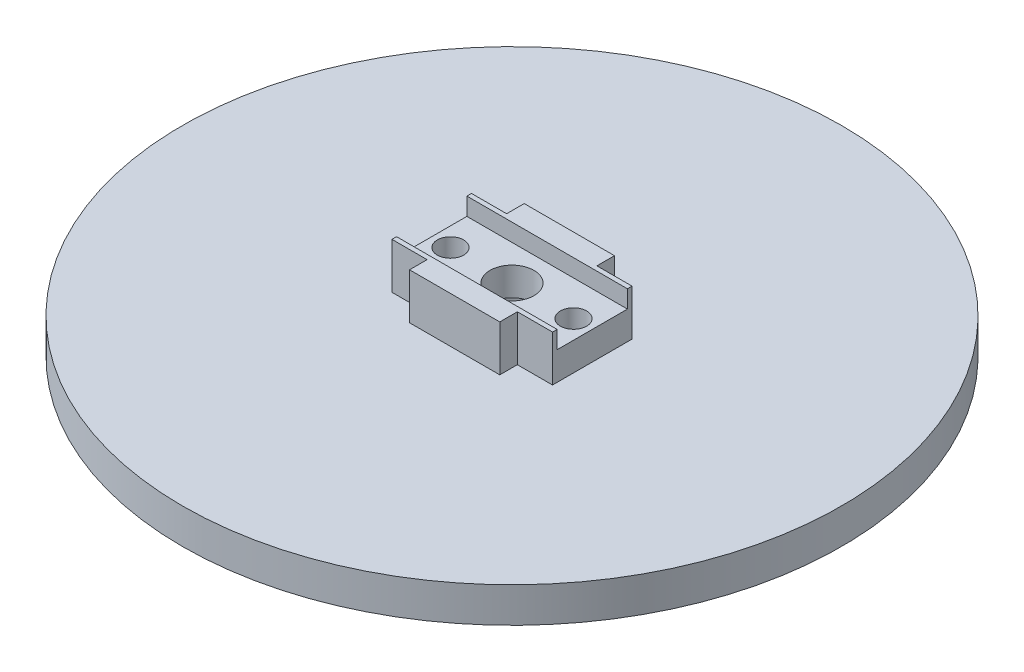
ISO-10303-21;
HEADER;
FILE_DESCRIPTION(('STEP AP214'),'2;1');
FILE_NAME('part.step','',(''),(''),'','','');
FILE_SCHEMA(('AUTOMOTIVE_DESIGN { 1 0 10303 214 1 1 1 1 }'));
ENDSEC;
DATA;
#1=APPLICATION_CONTEXT('core data for automotive mechanical design processes');
#2=APPLICATION_PROTOCOL_DEFINITION('international standard','automotive_design',2000,#1);
#3=PRODUCT_CONTEXT('',#1,'mechanical');
#4=PRODUCT('Part','Part','',(#3));
#5=PRODUCT_RELATED_PRODUCT_CATEGORY('part','',(#4));
#6=PRODUCT_DEFINITION_FORMATION('','',#4);
#7=PRODUCT_DEFINITION_CONTEXT('part definition',#1,'design');
#8=PRODUCT_DEFINITION('design','',#6,#7);
#9=PRODUCT_DEFINITION_SHAPE('','',#8);
#10=(LENGTH_UNIT() NAMED_UNIT(*) SI_UNIT(.MILLI.,.METRE.));
#11=(NAMED_UNIT(*) PLANE_ANGLE_UNIT() SI_UNIT($,.RADIAN.));
#12=(NAMED_UNIT(*) SI_UNIT($,.STERADIAN.) SOLID_ANGLE_UNIT());
#13=UNCERTAINTY_MEASURE_WITH_UNIT(LENGTH_MEASURE(1.E-05),#10,'distance_accuracy_value','');
#14=(GEOMETRIC_REPRESENTATION_CONTEXT(3) GLOBAL_UNCERTAINTY_ASSIGNED_CONTEXT((#13)) GLOBAL_UNIT_ASSIGNED_CONTEXT((#10,
#11,#12)) REPRESENTATION_CONTEXT('',''));
#15=CARTESIAN_POINT('',(0.,0.,0.));
#16=DIRECTION('',(0.,0.,1.));
#17=DIRECTION('',(1.,0.,0.));
#18=AXIS2_PLACEMENT_3D('',#15,#16,#17);
#19=CARTESIAN_POINT('',(0.,9.22,0.));
#20=DIRECTION('',(0.,1.,0.));
#21=DIRECTION('',(0.,0.,1.));
#22=AXIS2_PLACEMENT_3D('',#19,#20,#21);
#23=PLANE('',#22);
#24=DIRECTION('',(1.,0.,0.));
#25=VECTOR('',#24,1.);
#26=CARTESIAN_POINT('',(0.,9.22,4.));
#27=LINE('',#26,#25);
#28=CARTESIAN_POINT('',(-9.135,9.22,4.));
#29=VERTEX_POINT('',#28);
#30=CARTESIAN_POINT('',(9.135,9.22,4.));
#31=VERTEX_POINT('',#30);
#32=EDGE_CURVE('E49',#29,#31,#27,.T.);
#33=ORIENTED_EDGE('',*,*,#32,.F.);
#34=DIRECTION('',(0.,0.,1.));
#35=VECTOR('',#34,1.);
#36=CARTESIAN_POINT('',(-9.135,9.22,-6.525));
#37=LINE('',#36,#35);
#38=CARTESIAN_POINT('',(-9.135,9.22,4.525));
#39=VERTEX_POINT('',#38);
#40=EDGE_CURVE('E182',#29,#39,#37,.T.);
#41=ORIENTED_EDGE('',*,*,#40,.T.);
#42=DIRECTION('',(-1.,0.,0.));
#43=VECTOR('',#42,1.);
#44=CARTESIAN_POINT('',(-5.135,9.22,4.525));
#45=LINE('',#44,#43);
#46=CARTESIAN_POINT('',(-5.135,9.22,4.525));
#47=VERTEX_POINT('',#46);
#48=EDGE_CURVE('E286',#47,#39,#45,.T.);
#49=ORIENTED_EDGE('',*,*,#48,.F.);
#50=DIRECTION('',(0.,0.,-1.));
#51=VECTOR('',#50,1.);
#52=CARTESIAN_POINT('',(-5.135,9.22,4.525));
#53=LINE('',#52,#51);
#54=CARTESIAN_POINT('',(-5.135,9.22,6.525));
#55=VERTEX_POINT('',#54);
#56=EDGE_CURVE('E282',#55,#47,#53,.T.);
#57=ORIENTED_EDGE('',*,*,#56,.F.);
#58=DIRECTION('',(1.,0.,0.));
#59=VECTOR('',#58,1.);
#60=CARTESIAN_POINT('',(-9.135,9.22,6.525));
#61=LINE('',#60,#59);
#62=CARTESIAN_POINT('',(5.135,9.22,6.525));
#63=VERTEX_POINT('',#62);
#64=EDGE_CURVE('E181',#55,#63,#61,.T.);
#65=ORIENTED_EDGE('',*,*,#64,.T.);
#66=DIRECTION('',(0.,0.,1.));
#67=VECTOR('',#66,1.);
#68=CARTESIAN_POINT('',(5.135,9.22,4.525));
#69=LINE('',#68,#67);
#70=CARTESIAN_POINT('',(5.135,9.22,4.525));
#71=VERTEX_POINT('',#70);
#72=EDGE_CURVE('E251',#71,#63,#69,.T.);
#73=ORIENTED_EDGE('',*,*,#72,.F.);
#74=DIRECTION('',(-1.,0.,0.));
#75=VECTOR('',#74,1.);
#76=CARTESIAN_POINT('',(9.135,9.22,4.525));
#77=LINE('',#76,#75);
#78=CARTESIAN_POINT('',(9.135,9.22,4.525));
#79=VERTEX_POINT('',#78);
#80=EDGE_CURVE('E250',#79,#71,#77,.T.);
#81=ORIENTED_EDGE('',*,*,#80,.F.);
#82=DIRECTION('',(0.,0.,-1.));
#83=VECTOR('',#82,1.);
#84=CARTESIAN_POINT('',(9.135,9.22,-6.525));
#85=LINE('',#84,#83);
#86=EDGE_CURVE('E194',#79,#31,#85,.T.);
#87=ORIENTED_EDGE('',*,*,#86,.T.);
#88=EDGE_LOOP('',(#33,#41,#49,#57,#65,#73,#81,#87));
#89=FACE_BOUND('',#88,.T.);
#90=ADVANCED_FACE('F40',(#89),#23,.T.);
#91=CARTESIAN_POINT('',(0.,4.,0.));
#92=DIRECTION('',(0.,1.,0.));
#93=DIRECTION('',(0.,0.,1.));
#94=AXIS2_PLACEMENT_3D('',#91,#92,#93);
#95=PLANE('',#94);
#96=DIRECTION('',(1.,0.,0.));
#97=VECTOR('',#96,1.);
#98=CARTESIAN_POINT('',(-5.135,4.,4.525));
#99=LINE('',#98,#97);
#100=CARTESIAN_POINT('',(-9.135,4.,4.525));
#101=VERTEX_POINT('',#100);
#102=CARTESIAN_POINT('',(-5.135,4.,4.525));
#103=VERTEX_POINT('',#102);
#104=EDGE_CURVE('E261',#101,#103,#99,.T.);
#105=ORIENTED_EDGE('',*,*,#104,.F.);
#106=DIRECTION('',(0.,0.,1.));
#107=VECTOR('',#106,1.);
#108=CARTESIAN_POINT('',(-9.135,4.,-6.525));
#109=LINE('',#108,#107);
#110=CARTESIAN_POINT('',(-9.135,4.,-4.525));
#111=VERTEX_POINT('',#110);
#112=EDGE_CURVE('E203',#111,#101,#109,.T.);
#113=ORIENTED_EDGE('',*,*,#112,.F.);
#114=DIRECTION('',(-1.,0.,0.));
#115=VECTOR('',#114,1.);
#116=CARTESIAN_POINT('',(-5.135,4.,-4.525));
#117=LINE('',#116,#115);
#118=CARTESIAN_POINT('',(-5.135,4.,-4.525));
#119=VERTEX_POINT('',#118);
#120=EDGE_CURVE('E191',#119,#111,#117,.T.);
#121=ORIENTED_EDGE('',*,*,#120,.F.);
#122=DIRECTION('',(0.,0.,1.));
#123=VECTOR('',#122,1.);
#124=CARTESIAN_POINT('',(-5.135,4.,-6.525));
#125=LINE('',#124,#123);
#126=CARTESIAN_POINT('',(-5.135,4.,-6.525));
#127=VERTEX_POINT('',#126);
#128=EDGE_CURVE('E321',#127,#119,#125,.T.);
#129=ORIENTED_EDGE('',*,*,#128,.F.);
#130=DIRECTION('',(-1.,0.,0.));
#131=VECTOR('',#130,1.);
#132=CARTESIAN_POINT('',(-9.135,4.,-6.525));
#133=LINE('',#132,#131);
#134=CARTESIAN_POINT('',(5.13499999999999,4.,-6.525));
#135=VERTEX_POINT('',#134);
#136=EDGE_CURVE('E189',#135,#127,#133,.T.);
#137=ORIENTED_EDGE('',*,*,#136,.F.);
#138=DIRECTION('',(0.,0.,-1.));
#139=VECTOR('',#138,1.);
#140=CARTESIAN_POINT('',(5.13499999999999,4.,-6.525));
#141=LINE('',#140,#139);
#142=CARTESIAN_POINT('',(5.13499999999999,4.,-4.525));
#143=VERTEX_POINT('',#142);
#144=EDGE_CURVE('E287',#143,#135,#141,.T.);
#145=ORIENTED_EDGE('',*,*,#144,.F.);
#146=DIRECTION('',(-1.,0.,0.));
#147=VECTOR('',#146,1.);
#148=CARTESIAN_POINT('',(9.13499999999999,4.,-4.525));
#149=LINE('',#148,#147);
#150=CARTESIAN_POINT('',(9.13499999999999,4.,-4.525));
#151=VERTEX_POINT('',#150);
#152=EDGE_CURVE('E300',#151,#143,#149,.T.);
#153=ORIENTED_EDGE('',*,*,#152,.F.);
#154=DIRECTION('',(0.,0.,-1.));
#155=VECTOR('',#154,1.);
#156=CARTESIAN_POINT('',(9.135,4.,-6.525));
#157=LINE('',#156,#155);
#158=CARTESIAN_POINT('',(9.135,4.,4.525));
#159=VERTEX_POINT('',#158);
#160=EDGE_CURVE('E211',#159,#151,#157,.T.);
#161=ORIENTED_EDGE('',*,*,#160,.F.);
#162=DIRECTION('',(1.,0.,0.));
#163=VECTOR('',#162,1.);
#164=CARTESIAN_POINT('',(9.135,4.,4.525));
#165=LINE('',#164,#163);
#166=CARTESIAN_POINT('',(5.135,4.,4.525));
#167=VERTEX_POINT('',#166);
#168=EDGE_CURVE('E276',#167,#159,#165,.T.);
#169=ORIENTED_EDGE('',*,*,#168,.F.);
#170=DIRECTION('',(0.,0.,-1.));
#171=VECTOR('',#170,1.);
#172=CARTESIAN_POINT('',(5.135,4.,4.525));
#173=LINE('',#172,#171);
#174=CARTESIAN_POINT('',(5.135,4.,6.525));
#175=VERTEX_POINT('',#174);
#176=EDGE_CURVE('E264',#175,#167,#173,.T.);
#177=ORIENTED_EDGE('',*,*,#176,.F.);
#178=DIRECTION('',(1.,0.,0.));
#179=VECTOR('',#178,1.);
#180=CARTESIAN_POINT('',(-9.135,4.,6.525));
#181=LINE('',#180,#179);
#182=CARTESIAN_POINT('',(-5.135,4.,6.525));
#183=VERTEX_POINT('',#182);
#184=EDGE_CURVE('E207',#183,#175,#181,.T.);
#185=ORIENTED_EDGE('',*,*,#184,.F.);
#186=DIRECTION('',(0.,0.,1.));
#187=VECTOR('',#186,1.);
#188=CARTESIAN_POINT('',(-5.135,4.,4.525));
#189=LINE('',#188,#187);
#190=EDGE_CURVE('E255',#103,#183,#189,.T.);
#191=ORIENTED_EDGE('',*,*,#190,.F.);
#192=EDGE_LOOP('',(#105,#113,#121,#129,#137,#145,#153,#161,#169,#177,#185,#191));
#193=FACE_BOUND('',#192,.T.);
#194=CARTESIAN_POINT('',(0.,4.,0.));
#195=DIRECTION('',(0.,1.,0.));
#196=DIRECTION('',(0.,0.,1.));
#197=AXIS2_PLACEMENT_3D('',#194,#195,#196);
#198=CIRCLE('',#197,37.5);
#199=CARTESIAN_POINT('',(0.,4.,37.5));
#200=VERTEX_POINT('',#199);
#201=EDGE_CURVE('E161',#200,#200,#198,.T.);
#202=ORIENTED_EDGE('',*,*,#201,.T.);
#203=EDGE_LOOP('',(#202));
#204=FACE_BOUND('',#203,.T.);
#205=ADVANCED_FACE('F343',(#193,#204),#95,.T.);
#206=CARTESIAN_POINT('',(0.,4.,0.));
#207=DIRECTION('',(0.,-1.,0.));
#208=DIRECTION('',(0.,0.,-1.));
#209=AXIS2_PLACEMENT_3D('',#206,#207,#208);
#210=CYLINDRICAL_SURFACE('',#209,37.5);
#211=ORIENTED_EDGE('',*,*,#201,.F.);
#212=EDGE_LOOP('',(#211));
#213=FACE_BOUND('',#212,.T.);
#214=CARTESIAN_POINT('',(0.,0.,0.));
#215=DIRECTION('',(0.,1.,0.));
#216=DIRECTION('',(0.,0.,1.));
#217=AXIS2_PLACEMENT_3D('',#214,#215,#216);
#218=CIRCLE('',#217,37.5);
#219=CARTESIAN_POINT('',(0.,0.,37.5));
#220=VERTEX_POINT('',#219);
#221=EDGE_CURVE('E225',#220,#220,#218,.T.);
#222=ORIENTED_EDGE('',*,*,#221,.T.);
#223=EDGE_LOOP('',(#222));
#224=FACE_BOUND('',#223,.T.);
#225=ADVANCED_FACE('F42',(#213,#224),#210,.T.);
#226=CARTESIAN_POINT('',(0.,0.,0.));
#227=DIRECTION('',(0.,1.,0.));
#228=DIRECTION('',(0.,0.,1.));
#229=AXIS2_PLACEMENT_3D('',#226,#227,#228);
#230=PLANE('',#229);
#231=CARTESIAN_POINT('',(0.,0.,0.));
#232=DIRECTION('',(0.,1.,0.));
#233=DIRECTION('',(0.,0.,1.));
#234=AXIS2_PLACEMENT_3D('',#231,#232,#233);
#235=CIRCLE('',#234,5.22);
#236=CARTESIAN_POINT('',(0.,0.,5.22));
#237=VERTEX_POINT('',#236);
#238=EDGE_CURVE('E221',#237,#237,#235,.T.);
#239=ORIENTED_EDGE('',*,*,#238,.T.);
#240=EDGE_LOOP('',(#239));
#241=FACE_BOUND('',#240,.T.);
#242=ORIENTED_EDGE('',*,*,#221,.F.);
#243=EDGE_LOOP('',(#242));
#244=FACE_BOUND('',#243,.T.);
#245=ADVANCED_FACE('F418',(#241,#244),#230,.F.);
#246=CARTESIAN_POINT('',(0.,-9.05,0.));
#247=DIRECTION('',(0.,1.,0.));
#248=DIRECTION('',(0.,0.,1.));
#249=AXIS2_PLACEMENT_3D('',#246,#247,#248);
#250=CYLINDRICAL_SURFACE('',#249,5.22);
#251=CARTESIAN_POINT('',(0.,4.,0.));
#252=DIRECTION('',(0.,1.,0.));
#253=DIRECTION('',(0.,0.,1.));
#254=AXIS2_PLACEMENT_3D('',#251,#252,#253);
#255=CIRCLE('',#254,5.22);
#256=CARTESIAN_POINT('',(0.,4.,5.22));
#257=VERTEX_POINT('',#256);
#258=EDGE_CURVE('E202',#257,#257,#255,.F.);
#259=ORIENTED_EDGE('',*,*,#258,.F.);
#260=EDGE_LOOP('',(#259));
#261=FACE_BOUND('',#260,.T.);
#262=ORIENTED_EDGE('',*,*,#238,.F.);
#263=EDGE_LOOP('',(#262));
#264=FACE_BOUND('',#263,.T.);
#265=ADVANCED_FACE('F416',(#261,#264),#250,.F.);
#266=CARTESIAN_POINT('',(0.,4.,0.));
#267=DIRECTION('',(0.,1.,0.));
#268=DIRECTION('',(0.,0.,1.));
#269=AXIS2_PLACEMENT_3D('',#266,#267,#268);
#270=PLANE('',#269);
#271=CARTESIAN_POINT('',(0.,4.,0.));
#272=DIRECTION('',(0.,1.,0.));
#273=DIRECTION('',(0.,0.,1.));
#274=AXIS2_PLACEMENT_3D('',#271,#272,#273);
#275=CIRCLE('',#274,2.5);
#276=CARTESIAN_POINT('',(0.,4.,2.5));
#277=VERTEX_POINT('',#276);
#278=EDGE_CURVE('E612',#277,#277,#275,.T.);
#279=ORIENTED_EDGE('',*,*,#278,.T.);
#280=EDGE_LOOP('',(#279));
#281=FACE_BOUND('',#280,.T.);
#282=ORIENTED_EDGE('',*,*,#258,.T.);
#283=EDGE_LOOP('',(#282));
#284=FACE_BOUND('',#283,.T.);
#285=ADVANCED_FACE('F410',(#281,#284),#270,.F.);
#286=CARTESIAN_POINT('',(-9.135,9.22,-6.525));
#287=DIRECTION('',(1.,0.,0.));
#288=DIRECTION('',(0.,0.,-1.));
#289=AXIS2_PLACEMENT_3D('',#286,#287,#288);
#290=PLANE('',#289);
#291=ORIENTED_EDGE('',*,*,#40,.F.);
#292=DIRECTION('',(0.,-1.,0.));
#293=VECTOR('',#292,1.);
#294=CARTESIAN_POINT('',(-9.135,9.22,4.));
#295=LINE('',#294,#293);
#296=CARTESIAN_POINT('',(-9.135,7.22,4.));
#297=VERTEX_POINT('',#296);
#298=EDGE_CURVE('E238',#29,#297,#295,.T.);
#299=ORIENTED_EDGE('',*,*,#298,.T.);
#300=DIRECTION('',(0.,0.,1.));
#301=VECTOR('',#300,1.);
#302=CARTESIAN_POINT('',(-9.135,7.22,-6.525));
#303=LINE('',#302,#301);
#304=CARTESIAN_POINT('',(-9.135,7.22,-4.));
#305=VERTEX_POINT('',#304);
#306=EDGE_CURVE('E171',#305,#297,#303,.T.);
#307=ORIENTED_EDGE('',*,*,#306,.F.);
#308=DIRECTION('',(0.,1.,0.));
#309=VECTOR('',#308,1.);
#310=CARTESIAN_POINT('',(-9.135,9.22,-4.));
#311=LINE('',#310,#309);
#312=CARTESIAN_POINT('',(-9.135,9.22,-4.));
#313=VERTEX_POINT('',#312);
#314=EDGE_CURVE('E155',#305,#313,#311,.T.);
#315=ORIENTED_EDGE('',*,*,#314,.T.);
#316=CARTESIAN_POINT('',(-9.135,9.22,-4.525));
#317=VERTEX_POINT('',#316);
#318=EDGE_CURVE('E169',#317,#313,#37,.T.);
#319=ORIENTED_EDGE('',*,*,#318,.F.);
#320=DIRECTION('',(0.,1.,0.));
#321=VECTOR('',#320,1.);
#322=CARTESIAN_POINT('',(-9.135,-0.472135954999581,-4.525));
#323=LINE('',#322,#321);
#324=EDGE_CURVE('E330',#111,#317,#323,.T.);
#325=ORIENTED_EDGE('',*,*,#324,.F.);
#326=ORIENTED_EDGE('',*,*,#112,.T.);
#327=DIRECTION('',(0.,1.,0.));
#328=VECTOR('',#327,1.);
#329=CARTESIAN_POINT('',(-9.135,-0.472135954999581,4.525));
#330=LINE('',#329,#328);
#331=EDGE_CURVE('E281',#101,#39,#330,.T.);
#332=ORIENTED_EDGE('',*,*,#331,.T.);
#333=EDGE_LOOP('',(#291,#299,#307,#315,#319,#325,#326,#332));
#334=FACE_BOUND('',#333,.T.);
#335=ADVANCED_FACE('F167',(#334),#290,.F.);
#336=CARTESIAN_POINT('',(-9.135,9.22,6.525));
#337=DIRECTION('',(0.,0.,-1.));
#338=DIRECTION('',(-1.,0.,0.));
#339=AXIS2_PLACEMENT_3D('',#336,#337,#338);
#340=PLANE('',#339);
#341=ORIENTED_EDGE('',*,*,#64,.F.);
#342=DIRECTION('',(0.,1.,0.));
#343=VECTOR('',#342,1.);
#344=CARTESIAN_POINT('',(-5.135,-0.472135954999581,6.525));
#345=LINE('',#344,#343);
#346=EDGE_CURVE('E291',#183,#55,#345,.T.);
#347=ORIENTED_EDGE('',*,*,#346,.F.);
#348=ORIENTED_EDGE('',*,*,#184,.T.);
#349=DIRECTION('',(0.,1.,0.));
#350=VECTOR('',#349,1.);
#351=CARTESIAN_POINT('',(5.135,-0.472135954999581,6.525));
#352=LINE('',#351,#350);
#353=EDGE_CURVE('E267',#175,#63,#352,.T.);
#354=ORIENTED_EDGE('',*,*,#353,.T.);
#355=EDGE_LOOP('',(#341,#347,#348,#354));
#356=FACE_BOUND('',#355,.T.);
#357=ADVANCED_FACE('F357',(#356),#340,.F.);
#358=CARTESIAN_POINT('',(9.135,9.22,-6.525));
#359=DIRECTION('',(-1.,0.,0.));
#360=DIRECTION('',(0.,0.,1.));
#361=AXIS2_PLACEMENT_3D('',#358,#359,#360);
#362=PLANE('',#361);
#363=DIRECTION('',(0.,0.,-1.));
#364=VECTOR('',#363,1.);
#365=CARTESIAN_POINT('',(9.135,7.22,-6.525));
#366=LINE('',#365,#364);
#367=CARTESIAN_POINT('',(9.13499999999999,7.22,4.));
#368=VERTEX_POINT('',#367);
#369=CARTESIAN_POINT('',(9.13499999999999,7.22,-4.));
#370=VERTEX_POINT('',#369);
#371=EDGE_CURVE('E11',#368,#370,#366,.T.);
#372=ORIENTED_EDGE('',*,*,#371,.F.);
#373=DIRECTION('',(0.,1.,0.));
#374=VECTOR('',#373,1.);
#375=CARTESIAN_POINT('',(9.135,9.22,4.));
#376=LINE('',#375,#374);
#377=EDGE_CURVE('E173',#368,#31,#376,.T.);
#378=ORIENTED_EDGE('',*,*,#377,.T.);
#379=ORIENTED_EDGE('',*,*,#86,.F.);
#380=DIRECTION('',(0.,1.,0.));
#381=VECTOR('',#380,1.);
#382=CARTESIAN_POINT('',(9.135,-0.472135954999581,4.525));
#383=LINE('',#382,#381);
#384=EDGE_CURVE('E259',#159,#79,#383,.T.);
#385=ORIENTED_EDGE('',*,*,#384,.F.);
#386=ORIENTED_EDGE('',*,*,#160,.T.);
#387=DIRECTION('',(0.,1.,0.));
#388=VECTOR('',#387,1.);
#389=CARTESIAN_POINT('',(9.13499999999999,-0.472135954999581,-4.525));
#390=LINE('',#389,#388);
#391=CARTESIAN_POINT('',(9.13499999999999,9.22,-4.525));
#392=VERTEX_POINT('',#391);
#393=EDGE_CURVE('E303',#151,#392,#390,.T.);
#394=ORIENTED_EDGE('',*,*,#393,.T.);
#395=CARTESIAN_POINT('',(9.135,9.22,-4.));
#396=VERTEX_POINT('',#395);
#397=EDGE_CURVE('E187',#396,#392,#85,.T.);
#398=ORIENTED_EDGE('',*,*,#397,.F.);
#399=DIRECTION('',(0.,-1.,0.));
#400=VECTOR('',#399,1.);
#401=CARTESIAN_POINT('',(9.135,9.22,-4.));
#402=LINE('',#401,#400);
#403=EDGE_CURVE('E56',#396,#370,#402,.T.);
#404=ORIENTED_EDGE('',*,*,#403,.T.);
#405=EDGE_LOOP('',(#372,#378,#379,#385,#386,#394,#398,#404));
#406=FACE_BOUND('',#405,.T.);
#407=ADVANCED_FACE('F243',(#406),#362,.F.);
#408=CARTESIAN_POINT('',(-9.135,9.22,-6.525));
#409=DIRECTION('',(0.,0.,1.));
#410=DIRECTION('',(1.,0.,0.));
#411=AXIS2_PLACEMENT_3D('',#408,#409,#410);
#412=PLANE('',#411);
#413=DIRECTION('',(-1.,0.,0.));
#414=VECTOR('',#413,1.);
#415=CARTESIAN_POINT('',(-9.135,9.22,-6.525));
#416=LINE('',#415,#414);
#417=CARTESIAN_POINT('',(5.135,9.22,-6.525));
#418=VERTEX_POINT('',#417);
#419=CARTESIAN_POINT('',(-5.135,9.22,-6.525));
#420=VERTEX_POINT('',#419);
#421=EDGE_CURVE('E198',#418,#420,#416,.T.);
#422=ORIENTED_EDGE('',*,*,#421,.F.);
#423=DIRECTION('',(0.,1.,0.));
#424=VECTOR('',#423,1.);
#425=CARTESIAN_POINT('',(5.13499999999999,-0.472135954999581,-6.525));
#426=LINE('',#425,#424);
#427=EDGE_CURVE('E64',#135,#418,#426,.T.);
#428=ORIENTED_EDGE('',*,*,#427,.F.);
#429=ORIENTED_EDGE('',*,*,#136,.T.);
#430=DIRECTION('',(0.,1.,0.));
#431=VECTOR('',#430,1.);
#432=CARTESIAN_POINT('',(-5.135,-0.472135954999581,-6.525));
#433=LINE('',#432,#431);
#434=EDGE_CURVE('E324',#127,#420,#433,.T.);
#435=ORIENTED_EDGE('',*,*,#434,.T.);
#436=EDGE_LOOP('',(#422,#428,#429,#435));
#437=FACE_BOUND('',#436,.T.);
#438=ADVANCED_FACE('F373',(#437),#412,.F.);
#439=DIRECTION('',(-1.,0.,0.));
#440=VECTOR('',#439,1.);
#441=CARTESIAN_POINT('',(0.,9.22,-4.));
#442=LINE('',#441,#440);
#443=EDGE_CURVE('E152',#396,#313,#442,.T.);
#444=ORIENTED_EDGE('',*,*,#443,.F.);
#445=ORIENTED_EDGE('',*,*,#397,.T.);
#446=DIRECTION('',(1.,0.,0.));
#447=VECTOR('',#446,1.);
#448=CARTESIAN_POINT('',(9.13499999999999,9.22,-4.525));
#449=LINE('',#448,#447);
#450=CARTESIAN_POINT('',(5.13499999999999,9.22,-4.525));
#451=VERTEX_POINT('',#450);
#452=EDGE_CURVE('E307',#451,#392,#449,.T.);
#453=ORIENTED_EDGE('',*,*,#452,.F.);
#454=DIRECTION('',(0.,0.,1.));
#455=VECTOR('',#454,1.);
#456=CARTESIAN_POINT('',(5.13499999999999,9.22,-6.525));
#457=LINE('',#456,#455);
#458=EDGE_CURVE('E304',#418,#451,#457,.T.);
#459=ORIENTED_EDGE('',*,*,#458,.F.);
#460=ORIENTED_EDGE('',*,*,#421,.T.);
#461=DIRECTION('',(0.,0.,-1.));
#462=VECTOR('',#461,1.);
#463=CARTESIAN_POINT('',(-5.135,9.22,-6.525));
#464=LINE('',#463,#462);
#465=CARTESIAN_POINT('',(-5.135,9.22,-4.525));
#466=VERTEX_POINT('',#465);
#467=EDGE_CURVE('E327',#466,#420,#464,.T.);
#468=ORIENTED_EDGE('',*,*,#467,.F.);
#469=DIRECTION('',(1.,0.,0.));
#470=VECTOR('',#469,1.);
#471=CARTESIAN_POINT('',(-5.135,9.22,-4.525));
#472=LINE('',#471,#470);
#473=EDGE_CURVE('E179',#317,#466,#472,.T.);
#474=ORIENTED_EDGE('',*,*,#473,.F.);
#475=ORIENTED_EDGE('',*,*,#318,.T.);
#476=EDGE_LOOP('',(#444,#445,#453,#459,#460,#468,#474,#475));
#477=FACE_BOUND('',#476,.T.);
#478=ADVANCED_FACE('F176',(#477),#23,.T.);
#479=CARTESIAN_POINT('',(-5.135,-0.472135954999581,-6.525));
#480=DIRECTION('',(1.,0.,0.));
#481=DIRECTION('',(0.,0.,-1.));
#482=AXIS2_PLACEMENT_3D('',#479,#480,#481);
#483=PLANE('',#482);
#484=ORIENTED_EDGE('',*,*,#128,.T.);
#485=DIRECTION('',(0.,1.,0.));
#486=VECTOR('',#485,1.);
#487=CARTESIAN_POINT('',(-5.135,-0.472135954999581,-4.525));
#488=LINE('',#487,#486);
#489=EDGE_CURVE('E334',#119,#466,#488,.T.);
#490=ORIENTED_EDGE('',*,*,#489,.T.);
#491=ORIENTED_EDGE('',*,*,#467,.T.);
#492=ORIENTED_EDGE('',*,*,#434,.F.);
#493=EDGE_LOOP('',(#484,#490,#491,#492));
#494=FACE_BOUND('',#493,.T.);
#495=ADVANCED_FACE('F377',(#494),#483,.F.);
#496=CARTESIAN_POINT('',(-5.135,-0.472135954999581,-4.525));
#497=DIRECTION('',(0.,0.,1.));
#498=DIRECTION('',(1.,0.,0.));
#499=AXIS2_PLACEMENT_3D('',#496,#497,#498);
#500=PLANE('',#499);
#501=ORIENTED_EDGE('',*,*,#120,.T.);
#502=ORIENTED_EDGE('',*,*,#324,.T.);
#503=ORIENTED_EDGE('',*,*,#473,.T.);
#504=ORIENTED_EDGE('',*,*,#489,.F.);
#505=EDGE_LOOP('',(#501,#502,#503,#504));
#506=FACE_BOUND('',#505,.T.);
#507=ADVANCED_FACE('F338',(#506),#500,.F.);
#508=CARTESIAN_POINT('',(5.135,-0.472135954999581,4.525));
#509=DIRECTION('',(-1.,0.,0.));
#510=DIRECTION('',(0.,0.,1.));
#511=AXIS2_PLACEMENT_3D('',#508,#509,#510);
#512=PLANE('',#511);
#513=ORIENTED_EDGE('',*,*,#176,.T.);
#514=DIRECTION('',(0.,1.,0.));
#515=VECTOR('',#514,1.);
#516=CARTESIAN_POINT('',(5.135,-0.472135954999581,4.525));
#517=LINE('',#516,#515);
#518=EDGE_CURVE('E271',#167,#71,#517,.T.);
#519=ORIENTED_EDGE('',*,*,#518,.T.);
#520=ORIENTED_EDGE('',*,*,#72,.T.);
#521=ORIENTED_EDGE('',*,*,#353,.F.);
#522=EDGE_LOOP('',(#513,#519,#520,#521));
#523=FACE_BOUND('',#522,.T.);
#524=ADVANCED_FACE('F360',(#523),#512,.F.);
#525=CARTESIAN_POINT('',(9.135,-0.472135954999581,4.525));
#526=DIRECTION('',(0.,0.,-1.));
#527=DIRECTION('',(-1.,0.,0.));
#528=AXIS2_PLACEMENT_3D('',#525,#526,#527);
#529=PLANE('',#528);
#530=ORIENTED_EDGE('',*,*,#168,.T.);
#531=ORIENTED_EDGE('',*,*,#384,.T.);
#532=ORIENTED_EDGE('',*,*,#80,.T.);
#533=ORIENTED_EDGE('',*,*,#518,.F.);
#534=EDGE_LOOP('',(#530,#531,#532,#533));
#535=FACE_BOUND('',#534,.T.);
#536=ADVANCED_FACE('F362',(#535),#529,.F.);
#537=CARTESIAN_POINT('',(-5.135,-0.472135954999581,4.525));
#538=DIRECTION('',(0.,0.,-1.));
#539=DIRECTION('',(-1.,0.,0.));
#540=AXIS2_PLACEMENT_3D('',#537,#538,#539);
#541=PLANE('',#540);
#542=ORIENTED_EDGE('',*,*,#104,.T.);
#543=DIRECTION('',(0.,1.,0.));
#544=VECTOR('',#543,1.);
#545=CARTESIAN_POINT('',(-5.135,-0.472135954999581,4.525));
#546=LINE('',#545,#544);
#547=EDGE_CURVE('E295',#103,#47,#546,.T.);
#548=ORIENTED_EDGE('',*,*,#547,.T.);
#549=ORIENTED_EDGE('',*,*,#48,.T.);
#550=ORIENTED_EDGE('',*,*,#331,.F.);
#551=EDGE_LOOP('',(#542,#548,#549,#550));
#552=FACE_BOUND('',#551,.T.);
#553=ADVANCED_FACE('F350',(#552),#541,.F.);
#554=CARTESIAN_POINT('',(-5.135,-0.472135954999581,4.525));
#555=DIRECTION('',(1.,0.,0.));
#556=DIRECTION('',(0.,0.,-1.));
#557=AXIS2_PLACEMENT_3D('',#554,#555,#556);
#558=PLANE('',#557);
#559=ORIENTED_EDGE('',*,*,#190,.T.);
#560=ORIENTED_EDGE('',*,*,#346,.T.);
#561=ORIENTED_EDGE('',*,*,#56,.T.);
#562=ORIENTED_EDGE('',*,*,#547,.F.);
#563=EDGE_LOOP('',(#559,#560,#561,#562));
#564=FACE_BOUND('',#563,.T.);
#565=ADVANCED_FACE('F389',(#564),#558,.F.);
#566=CARTESIAN_POINT('',(9.13499999999999,-0.472135954999581,-4.525));
#567=DIRECTION('',(0.,0.,1.));
#568=DIRECTION('',(1.,0.,0.));
#569=AXIS2_PLACEMENT_3D('',#566,#567,#568);
#570=PLANE('',#569);
#571=ORIENTED_EDGE('',*,*,#152,.T.);
#572=DIRECTION('',(0.,1.,0.));
#573=VECTOR('',#572,1.);
#574=CARTESIAN_POINT('',(5.13499999999999,-0.472135954999581,-4.525));
#575=LINE('',#574,#573);
#576=EDGE_CURVE('E314',#143,#451,#575,.T.);
#577=ORIENTED_EDGE('',*,*,#576,.T.);
#578=ORIENTED_EDGE('',*,*,#452,.T.);
#579=ORIENTED_EDGE('',*,*,#393,.F.);
#580=EDGE_LOOP('',(#571,#577,#578,#579));
#581=FACE_BOUND('',#580,.T.);
#582=ADVANCED_FACE('F367',(#581),#570,.F.);
#583=CARTESIAN_POINT('',(5.13499999999999,-0.472135954999581,-6.525));
#584=DIRECTION('',(-1.,0.,0.));
#585=DIRECTION('',(0.,0.,1.));
#586=AXIS2_PLACEMENT_3D('',#583,#584,#585);
#587=PLANE('',#586);
#588=ORIENTED_EDGE('',*,*,#144,.T.);
#589=ORIENTED_EDGE('',*,*,#427,.T.);
#590=ORIENTED_EDGE('',*,*,#458,.T.);
#591=ORIENTED_EDGE('',*,*,#576,.F.);
#592=EDGE_LOOP('',(#588,#589,#590,#591));
#593=FACE_BOUND('',#592,.T.);
#594=ADVANCED_FACE('F378',(#593),#587,.F.);
#595=CARTESIAN_POINT('',(0.,7.22,0.));
#596=DIRECTION('',(0.,1.,0.));
#597=DIRECTION('',(0.,0.,1.));
#598=AXIS2_PLACEMENT_3D('',#595,#596,#597);
#599=PLANE('',#598);
#600=CARTESIAN_POINT('',(0.,7.22,0.));
#601=DIRECTION('',(0.,1.,0.));
#602=DIRECTION('',(0.,0.,1.));
#603=AXIS2_PLACEMENT_3D('',#600,#601,#602);
#604=CIRCLE('',#603,2.5);
#605=CARTESIAN_POINT('',(0.,7.22,2.5));
#606=VERTEX_POINT('',#605);
#607=EDGE_CURVE('E609',#606,#606,#604,.T.);
#608=ORIENTED_EDGE('',*,*,#607,.F.);
#609=EDGE_LOOP('',(#608));
#610=FACE_BOUND('',#609,.T.);
#611=CARTESIAN_POINT('',(-7.,7.22,0.));
#612=DIRECTION('',(0.,1.,0.));
#613=DIRECTION('',(0.,0.,1.));
#614=AXIS2_PLACEMENT_3D('',#611,#612,#613);
#615=CIRCLE('',#614,1.5);
#616=CARTESIAN_POINT('',(-7.,7.22,1.5));
#617=VERTEX_POINT('',#616);
#618=EDGE_CURVE('E628',#617,#617,#615,.T.);
#619=ORIENTED_EDGE('',*,*,#618,.F.);
#620=EDGE_LOOP('',(#619));
#621=FACE_BOUND('',#620,.T.);
#622=CARTESIAN_POINT('',(7.,7.22,0.));
#623=DIRECTION('',(0.,1.,0.));
#624=DIRECTION('',(0.,0.,1.));
#625=AXIS2_PLACEMENT_3D('',#622,#623,#624);
#626=CIRCLE('',#625,1.5);
#627=CARTESIAN_POINT('',(7.,7.22,1.5));
#628=VERTEX_POINT('',#627);
#629=EDGE_CURVE('E614',#628,#628,#626,.T.);
#630=ORIENTED_EDGE('',*,*,#629,.F.);
#631=EDGE_LOOP('',(#630));
#632=FACE_BOUND('',#631,.T.);
#633=ORIENTED_EDGE('',*,*,#306,.T.);
#634=DIRECTION('',(1.,0.,0.));
#635=VECTOR('',#634,1.);
#636=CARTESIAN_POINT('',(-26.832275100702,7.22,4.));
#637=LINE('',#636,#635);
#638=EDGE_CURVE('E637',#297,#368,#637,.T.);
#639=ORIENTED_EDGE('',*,*,#638,.T.);
#640=ORIENTED_EDGE('',*,*,#371,.T.);
#641=DIRECTION('',(-1.,0.,0.));
#642=VECTOR('',#641,1.);
#643=CARTESIAN_POINT('',(-26.832275100702,7.22,-4.));
#644=LINE('',#643,#642);
#645=EDGE_CURVE('E627',#370,#305,#644,.T.);
#646=ORIENTED_EDGE('',*,*,#645,.T.);
#647=EDGE_LOOP('',(#633,#639,#640,#646));
#648=FACE_BOUND('',#647,.T.);
#649=ADVANCED_FACE('F380',(#610,#621,#632,#648),#599,.T.);
#650=CARTESIAN_POINT('',(-26.832275100702,7.22,4.));
#651=DIRECTION('',(0.,0.,1.));
#652=DIRECTION('',(1.,0.,0.));
#653=AXIS2_PLACEMENT_3D('',#650,#651,#652);
#654=PLANE('',#653);
#655=ORIENTED_EDGE('',*,*,#32,.T.);
#656=ORIENTED_EDGE('',*,*,#377,.F.);
#657=ORIENTED_EDGE('',*,*,#638,.F.);
#658=ORIENTED_EDGE('',*,*,#298,.F.);
#659=EDGE_LOOP('',(#655,#656,#657,#658));
#660=FACE_BOUND('',#659,.T.);
#661=ADVANCED_FACE('F235',(#660),#654,.F.);
#662=CARTESIAN_POINT('',(-26.832275100702,7.22,-4.));
#663=DIRECTION('',(0.,0.,-1.));
#664=DIRECTION('',(-1.,0.,0.));
#665=AXIS2_PLACEMENT_3D('',#662,#663,#664);
#666=PLANE('',#665);
#667=ORIENTED_EDGE('',*,*,#645,.F.);
#668=ORIENTED_EDGE('',*,*,#403,.F.);
#669=ORIENTED_EDGE('',*,*,#443,.T.);
#670=ORIENTED_EDGE('',*,*,#314,.F.);
#671=EDGE_LOOP('',(#667,#668,#669,#670));
#672=FACE_BOUND('',#671,.T.);
#673=ADVANCED_FACE('F154',(#672),#666,.F.);
#674=CARTESIAN_POINT('',(7.,3.22,0.));
#675=DIRECTION('',(0.,1.,0.));
#676=DIRECTION('',(0.,0.,1.));
#677=AXIS2_PLACEMENT_3D('',#674,#675,#676);
#678=CYLINDRICAL_SURFACE('',#677,1.5);
#679=CARTESIAN_POINT('',(7.,3.22,0.));
#680=DIRECTION('',(0.,1.,0.));
#681=DIRECTION('',(0.,0.,1.));
#682=AXIS2_PLACEMENT_3D('',#679,#680,#681);
#683=CIRCLE('',#682,1.5);
#684=CARTESIAN_POINT('',(7.,3.22,1.5));
#685=VERTEX_POINT('',#684);
#686=EDGE_CURVE('E619',#685,#685,#683,.T.);
#687=ORIENTED_EDGE('',*,*,#686,.F.);
#688=EDGE_LOOP('',(#687));
#689=FACE_BOUND('',#688,.T.);
#690=ORIENTED_EDGE('',*,*,#629,.T.);
#691=EDGE_LOOP('',(#690));
#692=FACE_BOUND('',#691,.T.);
#693=ADVANCED_FACE('F547',(#689,#692),#678,.F.);
#694=CARTESIAN_POINT('',(7.,3.22,0.));
#695=DIRECTION('',(0.,1.,0.));
#696=DIRECTION('',(0.,0.,1.));
#697=AXIS2_PLACEMENT_3D('',#694,#695,#696);
#698=PLANE('',#697);
#699=ORIENTED_EDGE('',*,*,#686,.T.);
#700=EDGE_LOOP('',(#699));
#701=FACE_BOUND('',#700,.T.);
#702=ADVANCED_FACE('F556',(#701),#698,.T.);
#703=CARTESIAN_POINT('',(-7.,3.22,0.));
#704=DIRECTION('',(0.,1.,0.));
#705=DIRECTION('',(0.,0.,1.));
#706=AXIS2_PLACEMENT_3D('',#703,#704,#705);
#707=CYLINDRICAL_SURFACE('',#706,1.5);
#708=CARTESIAN_POINT('',(-7.,3.22,0.));
#709=DIRECTION('',(0.,1.,0.));
#710=DIRECTION('',(0.,0.,1.));
#711=AXIS2_PLACEMENT_3D('',#708,#709,#710);
#712=CIRCLE('',#711,1.5);
#713=CARTESIAN_POINT('',(-7.,3.22,1.5));
#714=VERTEX_POINT('',#713);
#715=EDGE_CURVE('E623',#714,#714,#712,.T.);
#716=ORIENTED_EDGE('',*,*,#715,.F.);
#717=EDGE_LOOP('',(#716));
#718=FACE_BOUND('',#717,.T.);
#719=ORIENTED_EDGE('',*,*,#618,.T.);
#720=EDGE_LOOP('',(#719));
#721=FACE_BOUND('',#720,.T.);
#722=ADVANCED_FACE('F566',(#718,#721),#707,.F.);
#723=CARTESIAN_POINT('',(-7.,3.22,0.));
#724=DIRECTION('',(0.,1.,0.));
#725=DIRECTION('',(0.,0.,1.));
#726=AXIS2_PLACEMENT_3D('',#723,#724,#725);
#727=PLANE('',#726);
#728=ORIENTED_EDGE('',*,*,#715,.T.);
#729=EDGE_LOOP('',(#728));
#730=FACE_BOUND('',#729,.T.);
#731=ADVANCED_FACE('F576',(#730),#727,.T.);
#732=CARTESIAN_POINT('',(0.,0.,0.));
#733=DIRECTION('',(0.,1.,0.));
#734=DIRECTION('',(0.,0.,1.));
#735=AXIS2_PLACEMENT_3D('',#732,#733,#734);
#736=CYLINDRICAL_SURFACE('',#735,2.5);
#737=ORIENTED_EDGE('',*,*,#607,.T.);
#738=EDGE_LOOP('',(#737));
#739=FACE_BOUND('',#738,.T.);
#740=ORIENTED_EDGE('',*,*,#278,.F.);
#741=EDGE_LOOP('',(#740));
#742=FACE_BOUND('',#741,.T.);
#743=ADVANCED_FACE('F586',(#739,#742),#736,.F.);
#744=CLOSED_SHELL('',(#90,#205,#225,#245,#265,#285,#335,#357,#407,#438,#478,#495,#507,#524,#536,
#553,#565,#582,#594,#649,#661,#673,#693,#702,#722,#731,#743));
#745=MANIFOLD_SOLID_BREP('B2',#744);
#746=ADVANCED_BREP_SHAPE_REPRESENTATION('',(#18,#745),#14);
#747=SHAPE_DEFINITION_REPRESENTATION(#9,#746);
ENDSEC;
END-ISO-10303-21;
